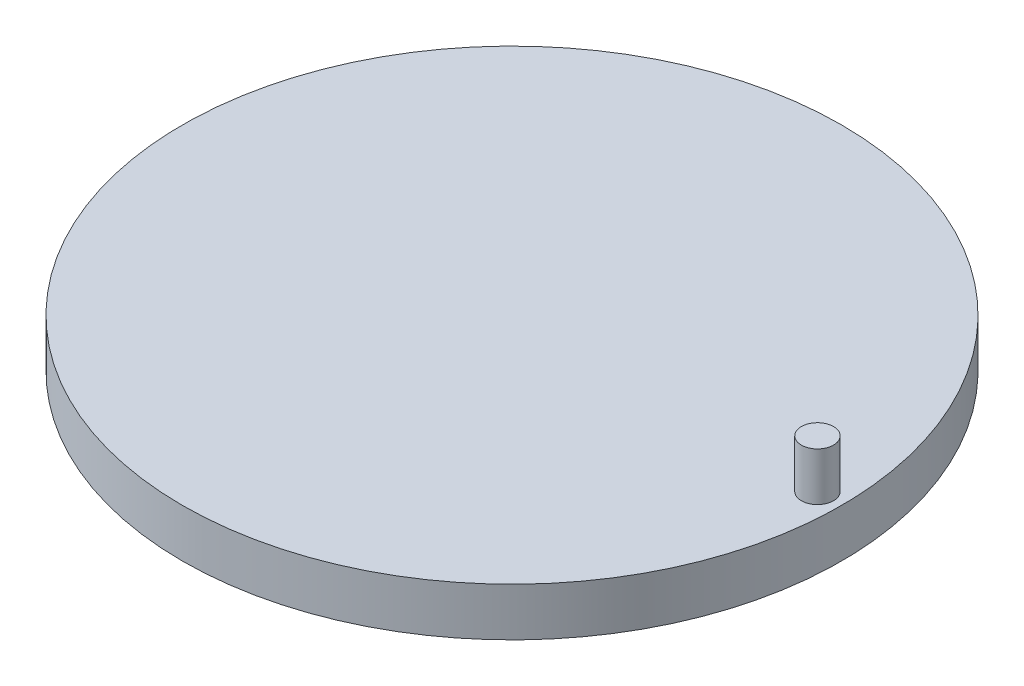
ISO-10303-21;
HEADER;
FILE_DESCRIPTION(('STEP AP214'),'2;1');
FILE_NAME('part.step','',(''),(''),'','','');
FILE_SCHEMA(('AUTOMOTIVE_DESIGN { 1 0 10303 214 1 1 1 1 }'));
ENDSEC;
DATA;
#1=APPLICATION_CONTEXT('core data for automotive mechanical design processes');
#2=APPLICATION_PROTOCOL_DEFINITION('international standard','automotive_design',2000,#1);
#3=PRODUCT_CONTEXT('',#1,'mechanical');
#4=PRODUCT('Part','Part','',(#3));
#5=PRODUCT_RELATED_PRODUCT_CATEGORY('part','',(#4));
#6=PRODUCT_DEFINITION_FORMATION('','',#4);
#7=PRODUCT_DEFINITION_CONTEXT('part definition',#1,'design');
#8=PRODUCT_DEFINITION('design','',#6,#7);
#9=PRODUCT_DEFINITION_SHAPE('','',#8);
#10=(LENGTH_UNIT() NAMED_UNIT(*) SI_UNIT(.MILLI.,.METRE.));
#11=(NAMED_UNIT(*) PLANE_ANGLE_UNIT() SI_UNIT($,.RADIAN.));
#12=(NAMED_UNIT(*) SI_UNIT($,.STERADIAN.) SOLID_ANGLE_UNIT());
#13=UNCERTAINTY_MEASURE_WITH_UNIT(LENGTH_MEASURE(1.E-05),#10,'distance_accuracy_value','');
#14=(GEOMETRIC_REPRESENTATION_CONTEXT(3) GLOBAL_UNCERTAINTY_ASSIGNED_CONTEXT((#13)) GLOBAL_UNIT_ASSIGNED_CONTEXT((#10,
#11,#12)) REPRESENTATION_CONTEXT('',''));
#15=CARTESIAN_POINT('',(0.,0.,0.));
#16=DIRECTION('',(0.,0.,1.));
#17=DIRECTION('',(1.,0.,0.));
#18=AXIS2_PLACEMENT_3D('',#15,#16,#17);
#19=CARTESIAN_POINT('',(0.,3.,0.));
#20=DIRECTION('',(0.,1.,0.));
#21=DIRECTION('',(0.,0.,1.));
#22=AXIS2_PLACEMENT_3D('',#19,#20,#21);
#23=PLANE('',#22);
#24=CARTESIAN_POINT('',(0.,3.,0.));
#25=DIRECTION('',(0.,1.,0.));
#26=DIRECTION('',(0.,0.,1.));
#27=AXIS2_PLACEMENT_3D('',#24,#25,#26);
#28=CIRCLE('',#27,20.5);
#29=CARTESIAN_POINT('',(0.,3.,20.5));
#30=VERTEX_POINT('',#29);
#31=EDGE_CURVE('E11',#30,#30,#28,.T.);
#32=ORIENTED_EDGE('',*,*,#31,.T.);
#33=EDGE_LOOP('',(#32));
#34=FACE_BOUND('',#33,.T.);
#35=CARTESIAN_POINT('',(19.,3.,0.));
#36=DIRECTION('',(0.,1.,0.));
#37=DIRECTION('',(0.,0.,1.));
#38=AXIS2_PLACEMENT_3D('',#35,#36,#37);
#39=CIRCLE('',#38,0.999999999999998);
#40=CARTESIAN_POINT('',(19.,3.,0.999999999999998));
#41=VERTEX_POINT('',#40);
#42=EDGE_CURVE('E49',#41,#41,#39,.T.);
#43=ORIENTED_EDGE('',*,*,#42,.F.);
#44=EDGE_LOOP('',(#43));
#45=FACE_BOUND('',#44,.T.);
#46=ADVANCED_FACE('F38',(#34,#45),#23,.T.);
#47=CARTESIAN_POINT('',(0.,0.,0.));
#48=DIRECTION('',(0.,1.,0.));
#49=DIRECTION('',(0.,0.,1.));
#50=AXIS2_PLACEMENT_3D('',#47,#48,#49);
#51=PLANE('',#50);
#52=CARTESIAN_POINT('',(0.,0.,0.));
#53=DIRECTION('',(0.,1.,0.));
#54=DIRECTION('',(0.,0.,1.));
#55=AXIS2_PLACEMENT_3D('',#52,#53,#54);
#56=CIRCLE('',#55,20.5);
#57=CARTESIAN_POINT('',(0.,0.,20.5));
#58=VERTEX_POINT('',#57);
#59=EDGE_CURVE('E42',#58,#58,#56,.T.);
#60=ORIENTED_EDGE('',*,*,#59,.F.);
#61=EDGE_LOOP('',(#60));
#62=FACE_BOUND('',#61,.T.);
#63=ADVANCED_FACE('F68',(#62),#51,.F.);
#64=CARTESIAN_POINT('',(0.,3.,0.));
#65=DIRECTION('',(0.,-1.,0.));
#66=DIRECTION('',(0.,0.,-1.));
#67=AXIS2_PLACEMENT_3D('',#64,#65,#66);
#68=CYLINDRICAL_SURFACE('',#67,20.5);
#69=ORIENTED_EDGE('',*,*,#31,.F.);
#70=EDGE_LOOP('',(#69));
#71=FACE_BOUND('',#70,.T.);
#72=ORIENTED_EDGE('',*,*,#59,.T.);
#73=EDGE_LOOP('',(#72));
#74=FACE_BOUND('',#73,.T.);
#75=ADVANCED_FACE('F40',(#71,#74),#68,.T.);
#76=CARTESIAN_POINT('',(19.,6.,0.));
#77=DIRECTION('',(0.,-1.,0.));
#78=DIRECTION('',(0.,0.,-1.));
#79=AXIS2_PLACEMENT_3D('',#76,#77,#78);
#80=CYLINDRICAL_SURFACE('',#79,0.999999999999998);
#81=ORIENTED_EDGE('',*,*,#42,.T.);
#82=EDGE_LOOP('',(#81));
#83=FACE_BOUND('',#82,.T.);
#84=CARTESIAN_POINT('',(19.,6.,0.));
#85=DIRECTION('',(0.,1.,0.));
#86=DIRECTION('',(0.,0.,1.));
#87=AXIS2_PLACEMENT_3D('',#84,#85,#86);
#88=CIRCLE('',#87,0.999999999999998);
#89=CARTESIAN_POINT('',(19.,6.,0.999999999999998));
#90=VERTEX_POINT('',#89);
#91=EDGE_CURVE('E53',#90,#90,#88,.T.);
#92=ORIENTED_EDGE('',*,*,#91,.F.);
#93=EDGE_LOOP('',(#92));
#94=FACE_BOUND('',#93,.T.);
#95=ADVANCED_FACE('F59',(#83,#94),#80,.T.);
#96=CARTESIAN_POINT('',(0.,6.,0.));
#97=DIRECTION('',(0.,1.,0.));
#98=DIRECTION('',(0.,0.,1.));
#99=AXIS2_PLACEMENT_3D('',#96,#97,#98);
#100=PLANE('',#99);
#101=ORIENTED_EDGE('',*,*,#91,.T.);
#102=EDGE_LOOP('',(#101));
#103=FACE_BOUND('',#102,.T.);
#104=ADVANCED_FACE('F57',(#103),#100,.T.);
#105=CLOSED_SHELL('',(#46,#63,#75,#95,#104));
#106=MANIFOLD_SOLID_BREP('B2',#105);
#107=ADVANCED_BREP_SHAPE_REPRESENTATION('',(#18,#106),#14);
#108=SHAPE_DEFINITION_REPRESENTATION(#9,#107);
ENDSEC;
END-ISO-10303-21;
